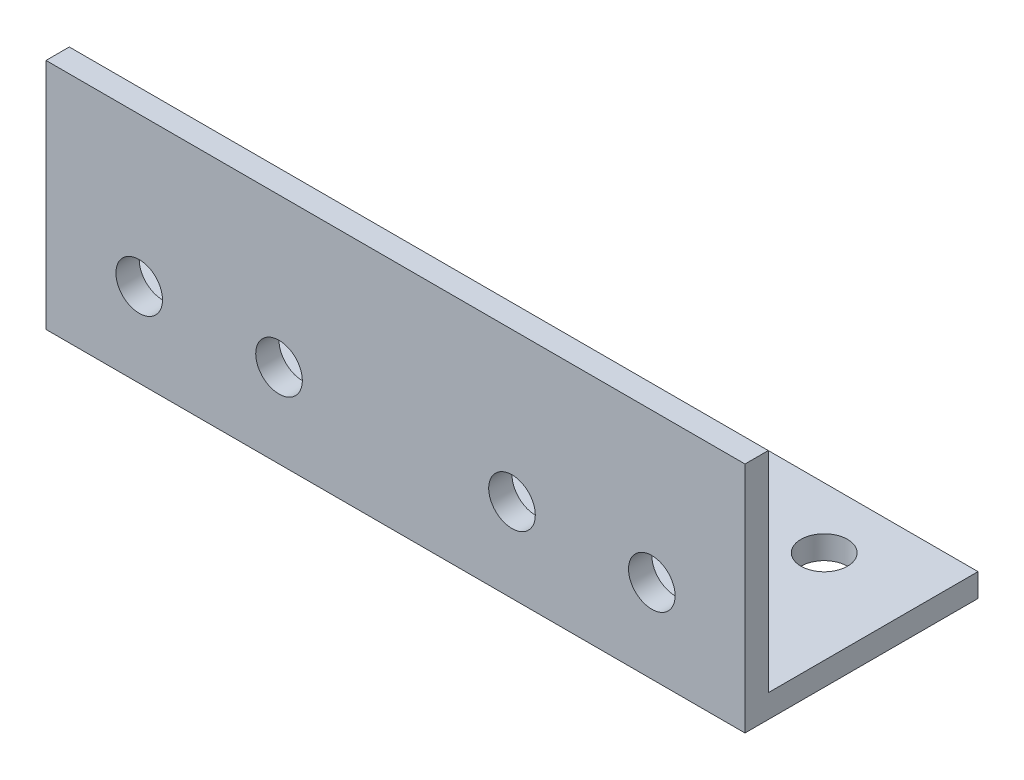
ISO-10303-21;
HEADER;
FILE_DESCRIPTION(('STEP AP214'),'2;1');
FILE_NAME('part.step','',(''),(''),'','','');
FILE_SCHEMA(('AUTOMOTIVE_DESIGN { 1 0 10303 214 1 1 1 1 }'));
ENDSEC;
DATA;
#1=APPLICATION_CONTEXT('core data for automotive mechanical design processes');
#2=APPLICATION_PROTOCOL_DEFINITION('international standard','automotive_design',2000,#1);
#3=PRODUCT_CONTEXT('',#1,'mechanical');
#4=PRODUCT('Part','Part','',(#3));
#5=PRODUCT_RELATED_PRODUCT_CATEGORY('part','',(#4));
#6=PRODUCT_DEFINITION_FORMATION('','',#4);
#7=PRODUCT_DEFINITION_CONTEXT('part definition',#1,'design');
#8=PRODUCT_DEFINITION('design','',#6,#7);
#9=PRODUCT_DEFINITION_SHAPE('','',#8);
#10=(LENGTH_UNIT() NAMED_UNIT(*) SI_UNIT(.MILLI.,.METRE.));
#11=(NAMED_UNIT(*) PLANE_ANGLE_UNIT() SI_UNIT($,.RADIAN.));
#12=(NAMED_UNIT(*) SI_UNIT($,.STERADIAN.) SOLID_ANGLE_UNIT());
#13=UNCERTAINTY_MEASURE_WITH_UNIT(LENGTH_MEASURE(1.E-05),#10,'distance_accuracy_value','');
#14=(GEOMETRIC_REPRESENTATION_CONTEXT(3) GLOBAL_UNCERTAINTY_ASSIGNED_CONTEXT((#13)) GLOBAL_UNIT_ASSIGNED_CONTEXT((#10,
#11,#12)) REPRESENTATION_CONTEXT('',''));
#15=CARTESIAN_POINT('',(0.,0.,0.));
#16=DIRECTION('',(0.,0.,1.));
#17=DIRECTION('',(1.,0.,0.));
#18=AXIS2_PLACEMENT_3D('',#15,#16,#17);
#19=CARTESIAN_POINT('',(150.,0.,0.));
#20=DIRECTION('',(0.,1.,0.));
#21=DIRECTION('',(0.,0.,1.));
#22=AXIS2_PLACEMENT_3D('',#19,#20,#21);
#23=PLANE('',#22);
#24=CARTESIAN_POINT('',(19.9999999999998,0.,-36.9999999999993));
#25=DIRECTION('',(0.,-1.,0.));
#26=DIRECTION('',(0.,0.,1.));
#27=AXIS2_PLACEMENT_3D('',#24,#25,#26);
#28=CIRCLE('',#27,4.99999999999999);
#29=CARTESIAN_POINT('',(19.9999999999998,0.,-31.9999999999993));
#30=VERTEX_POINT('',#29);
#31=EDGE_CURVE('E153',#30,#30,#28,.T.);
#32=ORIENTED_EDGE('',*,*,#31,.F.);
#33=EDGE_LOOP('',(#32));
#34=FACE_BOUND('',#33,.T.);
#35=CARTESIAN_POINT('',(49.9999999999998,0.,-36.9999999999998));
#36=DIRECTION('',(0.,-1.,0.));
#37=DIRECTION('',(0.,0.,1.));
#38=AXIS2_PLACEMENT_3D('',#35,#36,#37);
#39=CIRCLE('',#38,5.);
#40=CARTESIAN_POINT('',(49.9999999999998,0.,-31.9999999999998));
#41=VERTEX_POINT('',#40);
#42=EDGE_CURVE('E143',#41,#41,#39,.T.);
#43=ORIENTED_EDGE('',*,*,#42,.F.);
#44=EDGE_LOOP('',(#43));
#45=FACE_BOUND('',#44,.T.);
#46=CARTESIAN_POINT('',(100.,0.,-37.));
#47=DIRECTION('',(0.,-1.,0.));
#48=DIRECTION('',(0.,0.,-1.));
#49=AXIS2_PLACEMENT_3D('',#46,#47,#48);
#50=CIRCLE('',#49,4.99999999999999);
#51=CARTESIAN_POINT('',(100.,0.,-42.));
#52=VERTEX_POINT('',#51);
#53=EDGE_CURVE('E140',#52,#52,#50,.T.);
#54=ORIENTED_EDGE('',*,*,#53,.F.);
#55=EDGE_LOOP('',(#54));
#56=FACE_BOUND('',#55,.T.);
#57=CARTESIAN_POINT('',(130.,0.,-36.9999999999998));
#58=DIRECTION('',(0.,-1.,0.));
#59=DIRECTION('',(0.,0.,-1.));
#60=AXIS2_PLACEMENT_3D('',#57,#58,#59);
#61=CIRCLE('',#60,4.99999999999999);
#62=CARTESIAN_POINT('',(130.,0.,-41.9999999999998));
#63=VERTEX_POINT('',#62);
#64=EDGE_CURVE('E137',#63,#63,#61,.T.);
#65=ORIENTED_EDGE('',*,*,#64,.F.);
#66=EDGE_LOOP('',(#65));
#67=FACE_BOUND('',#66,.T.);
#68=DIRECTION('',(0.,0.,-1.));
#69=VECTOR('',#68,1.);
#70=CARTESIAN_POINT('',(0.,0.,0.));
#71=LINE('',#70,#69);
#72=CARTESIAN_POINT('',(0.,0.,0.));
#73=VERTEX_POINT('',#72);
#74=CARTESIAN_POINT('',(0.,0.,-50.));
#75=VERTEX_POINT('',#74);
#76=EDGE_CURVE('E117',#73,#75,#71,.T.);
#77=ORIENTED_EDGE('',*,*,#76,.T.);
#78=DIRECTION('',(-1.,0.,0.));
#79=VECTOR('',#78,1.);
#80=CARTESIAN_POINT('',(150.,0.,-50.));
#81=LINE('',#80,#79);
#82=CARTESIAN_POINT('',(150.,0.,-50.));
#83=VERTEX_POINT('',#82);
#84=EDGE_CURVE('E11',#83,#75,#81,.T.);
#85=ORIENTED_EDGE('',*,*,#84,.F.);
#86=DIRECTION('',(0.,0.,-1.));
#87=VECTOR('',#86,1.);
#88=CARTESIAN_POINT('',(150.,0.,0.));
#89=LINE('',#88,#87);
#90=CARTESIAN_POINT('',(150.,0.,0.));
#91=VERTEX_POINT('',#90);
#92=EDGE_CURVE('E82',#91,#83,#89,.T.);
#93=ORIENTED_EDGE('',*,*,#92,.F.);
#94=DIRECTION('',(-1.,0.,0.));
#95=VECTOR('',#94,1.);
#96=CARTESIAN_POINT('',(150.,0.,0.));
#97=LINE('',#96,#95);
#98=EDGE_CURVE('E113',#91,#73,#97,.T.);
#99=ORIENTED_EDGE('',*,*,#98,.T.);
#100=EDGE_LOOP('',(#77,#85,#93,#99));
#101=FACE_BOUND('',#100,.T.);
#102=ADVANCED_FACE('F34',(#34,#45,#56,#67,#101),#23,.F.);
#103=CARTESIAN_POINT('',(150.,5.,-50.));
#104=DIRECTION('',(0.,0.,-1.));
#105=DIRECTION('',(-1.,0.,0.));
#106=AXIS2_PLACEMENT_3D('',#103,#104,#105);
#107=PLANE('',#106);
#108=DIRECTION('',(0.,-1.,0.));
#109=VECTOR('',#108,1.);
#110=CARTESIAN_POINT('',(0.,5.,-50.));
#111=LINE('',#110,#109);
#112=CARTESIAN_POINT('',(0.,5.,-50.));
#113=VERTEX_POINT('',#112);
#114=EDGE_CURVE('E120',#113,#75,#111,.T.);
#115=ORIENTED_EDGE('',*,*,#114,.F.);
#116=DIRECTION('',(-1.,0.,0.));
#117=VECTOR('',#116,1.);
#118=CARTESIAN_POINT('',(150.,5.,-50.));
#119=LINE('',#118,#117);
#120=CARTESIAN_POINT('',(150.,5.,-50.));
#121=VERTEX_POINT('',#120);
#122=EDGE_CURVE('E43',#121,#113,#119,.T.);
#123=ORIENTED_EDGE('',*,*,#122,.F.);
#124=DIRECTION('',(0.,-1.,0.));
#125=VECTOR('',#124,1.);
#126=CARTESIAN_POINT('',(150.,5.,-50.));
#127=LINE('',#126,#125);
#128=EDGE_CURVE('E160',#121,#83,#127,.T.);
#129=ORIENTED_EDGE('',*,*,#128,.T.);
#130=ORIENTED_EDGE('',*,*,#84,.T.);
#131=EDGE_LOOP('',(#115,#123,#129,#130));
#132=FACE_BOUND('',#131,.T.);
#133=ADVANCED_FACE('F184',(#132),#107,.T.);
#134=CARTESIAN_POINT('',(150.,5.,0.));
#135=DIRECTION('',(0.,1.,0.));
#136=DIRECTION('',(0.,0.,1.));
#137=AXIS2_PLACEMENT_3D('',#134,#135,#136);
#138=PLANE('',#137);
#139=CARTESIAN_POINT('',(19.9999999999998,5.,-36.9999999999993));
#140=DIRECTION('',(0.,1.,0.));
#141=DIRECTION('',(0.,0.,1.));
#142=AXIS2_PLACEMENT_3D('',#139,#140,#141);
#143=CIRCLE('',#142,4.99999999999999);
#144=CARTESIAN_POINT('',(19.9999999999998,5.,-31.9999999999993));
#145=VERTEX_POINT('',#144);
#146=EDGE_CURVE('E37',#145,#145,#143,.T.);
#147=ORIENTED_EDGE('',*,*,#146,.F.);
#148=EDGE_LOOP('',(#147));
#149=FACE_BOUND('',#148,.T.);
#150=CARTESIAN_POINT('',(49.9999999999998,5.,-36.9999999999998));
#151=DIRECTION('',(0.,1.,0.));
#152=DIRECTION('',(0.,0.,1.));
#153=AXIS2_PLACEMENT_3D('',#150,#151,#152);
#154=CIRCLE('',#153,5.);
#155=CARTESIAN_POINT('',(49.9999999999998,5.,-31.9999999999998));
#156=VERTEX_POINT('',#155);
#157=EDGE_CURVE('E141',#156,#156,#154,.T.);
#158=ORIENTED_EDGE('',*,*,#157,.F.);
#159=EDGE_LOOP('',(#158));
#160=FACE_BOUND('',#159,.T.);
#161=CARTESIAN_POINT('',(100.,5.,-37.));
#162=DIRECTION('',(0.,1.,0.));
#163=DIRECTION('',(0.,0.,1.));
#164=AXIS2_PLACEMENT_3D('',#161,#162,#163);
#165=CIRCLE('',#164,4.99999999999999);
#166=CARTESIAN_POINT('',(100.,5.,-32.));
#167=VERTEX_POINT('',#166);
#168=EDGE_CURVE('E138',#167,#167,#165,.T.);
#169=ORIENTED_EDGE('',*,*,#168,.F.);
#170=EDGE_LOOP('',(#169));
#171=FACE_BOUND('',#170,.T.);
#172=CARTESIAN_POINT('',(130.,5.,-36.9999999999998));
#173=DIRECTION('',(0.,1.,0.));
#174=DIRECTION('',(0.,0.,1.));
#175=AXIS2_PLACEMENT_3D('',#172,#173,#174);
#176=CIRCLE('',#175,4.99999999999999);
#177=CARTESIAN_POINT('',(130.,5.,-31.9999999999998));
#178=VERTEX_POINT('',#177);
#179=EDGE_CURVE('E121',#178,#178,#176,.T.);
#180=ORIENTED_EDGE('',*,*,#179,.F.);
#181=EDGE_LOOP('',(#180));
#182=FACE_BOUND('',#181,.T.);
#183=DIRECTION('',(0.,0.,-1.));
#184=VECTOR('',#183,1.);
#185=CARTESIAN_POINT('',(0.,5.,0.));
#186=LINE('',#185,#184);
#187=CARTESIAN_POINT('',(0.,5.,-5.));
#188=VERTEX_POINT('',#187);
#189=EDGE_CURVE('E124',#188,#113,#186,.T.);
#190=ORIENTED_EDGE('',*,*,#189,.F.);
#191=DIRECTION('',(-1.,0.,0.));
#192=VECTOR('',#191,1.);
#193=CARTESIAN_POINT('',(150.,5.,-5.));
#194=LINE('',#193,#192);
#195=CARTESIAN_POINT('',(150.,5.,-5.));
#196=VERTEX_POINT('',#195);
#197=EDGE_CURVE('E103',#196,#188,#194,.T.);
#198=ORIENTED_EDGE('',*,*,#197,.F.);
#199=DIRECTION('',(0.,0.,-1.));
#200=VECTOR('',#199,1.);
#201=CARTESIAN_POINT('',(150.,5.,0.));
#202=LINE('',#201,#200);
#203=EDGE_CURVE('E109',#196,#121,#202,.T.);
#204=ORIENTED_EDGE('',*,*,#203,.T.);
#205=ORIENTED_EDGE('',*,*,#122,.T.);
#206=EDGE_LOOP('',(#190,#198,#204,#205));
#207=FACE_BOUND('',#206,.T.);
#208=ADVANCED_FACE('F164',(#149,#160,#171,#182,#207),#138,.T.);
#209=CARTESIAN_POINT('',(150.,0.,-5.));
#210=DIRECTION('',(0.,0.,-1.));
#211=DIRECTION('',(-1.,0.,0.));
#212=AXIS2_PLACEMENT_3D('',#209,#210,#211);
#213=PLANE('',#212);
#214=CARTESIAN_POINT('',(20.0000000000037,18.0000000000002,-5.));
#215=DIRECTION('',(0.,0.,-1.));
#216=DIRECTION('',(-1.,0.,0.));
#217=AXIS2_PLACEMENT_3D('',#214,#215,#216);
#218=CIRCLE('',#217,5.00000000000002);
#219=CARTESIAN_POINT('',(15.0000000000037,18.0000000000002,-5.));
#220=VERTEX_POINT('',#219);
#221=EDGE_CURVE('E237',#220,#220,#218,.T.);
#222=ORIENTED_EDGE('',*,*,#221,.F.);
#223=EDGE_LOOP('',(#222));
#224=FACE_BOUND('',#223,.T.);
#225=CARTESIAN_POINT('',(50.0000000000037,18.,-5.));
#226=DIRECTION('',(0.,0.,-1.));
#227=DIRECTION('',(-1.,0.,0.));
#228=AXIS2_PLACEMENT_3D('',#225,#226,#227);
#229=CIRCLE('',#228,5.00000000000002);
#230=CARTESIAN_POINT('',(45.0000000000037,18.,-5.));
#231=VERTEX_POINT('',#230);
#232=EDGE_CURVE('E246',#231,#231,#229,.T.);
#233=ORIENTED_EDGE('',*,*,#232,.F.);
#234=EDGE_LOOP('',(#233));
#235=FACE_BOUND('',#234,.T.);
#236=CARTESIAN_POINT('',(99.9999999999963,18.,-5.));
#237=DIRECTION('',(0.,0.,-1.));
#238=DIRECTION('',(-1.,0.,0.));
#239=AXIS2_PLACEMENT_3D('',#236,#237,#238);
#240=CIRCLE('',#239,5.00000000000002);
#241=CARTESIAN_POINT('',(94.9999999999963,18.,-5.));
#242=VERTEX_POINT('',#241);
#243=EDGE_CURVE('E252',#242,#242,#240,.T.);
#244=ORIENTED_EDGE('',*,*,#243,.F.);
#245=EDGE_LOOP('',(#244));
#246=FACE_BOUND('',#245,.T.);
#247=CARTESIAN_POINT('',(129.999999999996,18.0000000000002,-5.));
#248=DIRECTION('',(0.,0.,-1.));
#249=DIRECTION('',(-1.,0.,0.));
#250=AXIS2_PLACEMENT_3D('',#247,#248,#249);
#251=CIRCLE('',#250,5.00000000000002);
#252=CARTESIAN_POINT('',(124.999999999996,18.0000000000002,-5.));
#253=VERTEX_POINT('',#252);
#254=EDGE_CURVE('E257',#253,#253,#251,.T.);
#255=ORIENTED_EDGE('',*,*,#254,.F.);
#256=EDGE_LOOP('',(#255));
#257=FACE_BOUND('',#256,.T.);
#258=DIRECTION('',(0.,1.,0.));
#259=VECTOR('',#258,1.);
#260=CARTESIAN_POINT('',(0.,0.,-5.));
#261=LINE('',#260,#259);
#262=CARTESIAN_POINT('',(0.,50.,-5.));
#263=VERTEX_POINT('',#262);
#264=EDGE_CURVE('E98',#263,#188,#261,.F.);
#265=ORIENTED_EDGE('',*,*,#264,.F.);
#266=DIRECTION('',(-1.,0.,0.));
#267=VECTOR('',#266,1.);
#268=CARTESIAN_POINT('',(150.,50.,-5.));
#269=LINE('',#268,#267);
#270=CARTESIAN_POINT('',(150.,50.,-5.));
#271=VERTEX_POINT('',#270);
#272=EDGE_CURVE('E93',#271,#263,#269,.T.);
#273=ORIENTED_EDGE('',*,*,#272,.F.);
#274=DIRECTION('',(0.,1.,0.));
#275=VECTOR('',#274,1.);
#276=CARTESIAN_POINT('',(150.,0.,-5.));
#277=LINE('',#276,#275);
#278=EDGE_CURVE('E96',#271,#196,#277,.F.);
#279=ORIENTED_EDGE('',*,*,#278,.T.);
#280=ORIENTED_EDGE('',*,*,#197,.T.);
#281=EDGE_LOOP('',(#265,#273,#279,#280));
#282=FACE_BOUND('',#281,.T.);
#283=ADVANCED_FACE('F95',(#224,#235,#246,#257,#282),#213,.T.);
#284=CARTESIAN_POINT('',(150.,50.,0.));
#285=DIRECTION('',(0.,1.,0.));
#286=DIRECTION('',(0.,0.,1.));
#287=AXIS2_PLACEMENT_3D('',#284,#285,#286);
#288=PLANE('',#287);
#289=DIRECTION('',(0.,0.,-1.));
#290=VECTOR('',#289,1.);
#291=CARTESIAN_POINT('',(0.,50.,0.));
#292=LINE('',#291,#290);
#293=CARTESIAN_POINT('',(0.,50.,0.));
#294=VERTEX_POINT('',#293);
#295=EDGE_CURVE('E128',#294,#263,#292,.T.);
#296=ORIENTED_EDGE('',*,*,#295,.F.);
#297=DIRECTION('',(-1.,0.,0.));
#298=VECTOR('',#297,1.);
#299=CARTESIAN_POINT('',(150.,50.,0.));
#300=LINE('',#299,#298);
#301=CARTESIAN_POINT('',(150.,50.,0.));
#302=VERTEX_POINT('',#301);
#303=EDGE_CURVE('E73',#302,#294,#300,.T.);
#304=ORIENTED_EDGE('',*,*,#303,.F.);
#305=DIRECTION('',(0.,0.,-1.));
#306=VECTOR('',#305,1.);
#307=CARTESIAN_POINT('',(150.,50.,0.));
#308=LINE('',#307,#306);
#309=EDGE_CURVE('E107',#302,#271,#308,.T.);
#310=ORIENTED_EDGE('',*,*,#309,.T.);
#311=ORIENTED_EDGE('',*,*,#272,.T.);
#312=EDGE_LOOP('',(#296,#304,#310,#311));
#313=FACE_BOUND('',#312,.T.);
#314=ADVANCED_FACE('F111',(#313),#288,.T.);
#315=CARTESIAN_POINT('',(150.,0.,0.));
#316=DIRECTION('',(0.,0.,-1.));
#317=DIRECTION('',(-1.,0.,0.));
#318=AXIS2_PLACEMENT_3D('',#315,#316,#317);
#319=PLANE('',#318);
#320=CARTESIAN_POINT('',(20.0000000000037,18.0000000000002,0.));
#321=DIRECTION('',(0.,0.,1.));
#322=DIRECTION('',(-1.,0.,0.));
#323=AXIS2_PLACEMENT_3D('',#320,#321,#322);
#324=CIRCLE('',#323,5.00000000000002);
#325=CARTESIAN_POINT('',(15.0000000000037,18.0000000000002,0.));
#326=VERTEX_POINT('',#325);
#327=EDGE_CURVE('E239',#326,#326,#324,.T.);
#328=ORIENTED_EDGE('',*,*,#327,.F.);
#329=EDGE_LOOP('',(#328));
#330=FACE_BOUND('',#329,.T.);
#331=CARTESIAN_POINT('',(50.0000000000037,18.,0.));
#332=DIRECTION('',(0.,0.,1.));
#333=DIRECTION('',(-1.,0.,0.));
#334=AXIS2_PLACEMENT_3D('',#331,#332,#333);
#335=CIRCLE('',#334,5.00000000000002);
#336=CARTESIAN_POINT('',(45.0000000000037,18.,0.));
#337=VERTEX_POINT('',#336);
#338=EDGE_CURVE('E241',#337,#337,#335,.T.);
#339=ORIENTED_EDGE('',*,*,#338,.F.);
#340=EDGE_LOOP('',(#339));
#341=FACE_BOUND('',#340,.T.);
#342=CARTESIAN_POINT('',(99.9999999999963,18.,0.));
#343=DIRECTION('',(0.,0.,1.));
#344=DIRECTION('',(1.,0.,0.));
#345=AXIS2_PLACEMENT_3D('',#342,#343,#344);
#346=CIRCLE('',#345,5.00000000000002);
#347=CARTESIAN_POINT('',(104.999999999996,18.,0.));
#348=VERTEX_POINT('',#347);
#349=EDGE_CURVE('E249',#348,#348,#346,.T.);
#350=ORIENTED_EDGE('',*,*,#349,.F.);
#351=EDGE_LOOP('',(#350));
#352=FACE_BOUND('',#351,.T.);
#353=CARTESIAN_POINT('',(129.999999999996,18.0000000000002,0.));
#354=DIRECTION('',(0.,0.,1.));
#355=DIRECTION('',(1.,0.,0.));
#356=AXIS2_PLACEMENT_3D('',#353,#354,#355);
#357=CIRCLE('',#356,5.00000000000002);
#358=CARTESIAN_POINT('',(134.999999999996,18.0000000000002,0.));
#359=VERTEX_POINT('',#358);
#360=EDGE_CURVE('E255',#359,#359,#357,.T.);
#361=ORIENTED_EDGE('',*,*,#360,.F.);
#362=EDGE_LOOP('',(#361));
#363=FACE_BOUND('',#362,.T.);
#364=DIRECTION('',(0.,-1.,0.));
#365=VECTOR('',#364,1.);
#366=CARTESIAN_POINT('',(0.,0.,0.));
#367=LINE('',#366,#365);
#368=EDGE_CURVE('E76',#294,#73,#367,.T.);
#369=ORIENTED_EDGE('',*,*,#368,.T.);
#370=ORIENTED_EDGE('',*,*,#98,.F.);
#371=DIRECTION('',(0.,-1.,0.));
#372=VECTOR('',#371,1.);
#373=CARTESIAN_POINT('',(150.,0.,0.));
#374=LINE('',#373,#372);
#375=EDGE_CURVE('E52',#302,#91,#374,.T.);
#376=ORIENTED_EDGE('',*,*,#375,.F.);
#377=ORIENTED_EDGE('',*,*,#303,.T.);
#378=EDGE_LOOP('',(#369,#370,#376,#377));
#379=FACE_BOUND('',#378,.T.);
#380=ADVANCED_FACE('F170',(#330,#341,#352,#363,#379),#319,.F.);
#381=CARTESIAN_POINT('',(150.,0.,0.));
#382=DIRECTION('',(-1.,0.,0.));
#383=DIRECTION('',(0.,0.,1.));
#384=AXIS2_PLACEMENT_3D('',#381,#382,#383);
#385=PLANE('',#384);
#386=ORIENTED_EDGE('',*,*,#92,.T.);
#387=ORIENTED_EDGE('',*,*,#128,.F.);
#388=ORIENTED_EDGE('',*,*,#203,.F.);
#389=ORIENTED_EDGE('',*,*,#278,.F.);
#390=ORIENTED_EDGE('',*,*,#309,.F.);
#391=ORIENTED_EDGE('',*,*,#375,.T.);
#392=EDGE_LOOP('',(#386,#387,#388,#389,#390,#391));
#393=FACE_BOUND('',#392,.T.);
#394=ADVANCED_FACE('F106',(#393),#385,.F.);
#395=CARTESIAN_POINT('',(0.,0.,0.));
#396=DIRECTION('',(-1.,0.,0.));
#397=DIRECTION('',(0.,0.,1.));
#398=AXIS2_PLACEMENT_3D('',#395,#396,#397);
#399=PLANE('',#398);
#400=ORIENTED_EDGE('',*,*,#76,.F.);
#401=ORIENTED_EDGE('',*,*,#368,.F.);
#402=ORIENTED_EDGE('',*,*,#295,.T.);
#403=ORIENTED_EDGE('',*,*,#264,.T.);
#404=ORIENTED_EDGE('',*,*,#189,.T.);
#405=ORIENTED_EDGE('',*,*,#114,.T.);
#406=EDGE_LOOP('',(#400,#401,#402,#403,#404,#405));
#407=FACE_BOUND('',#406,.T.);
#408=ADVANCED_FACE('F168',(#407),#399,.T.);
#409=CARTESIAN_POINT('',(130.,50.,-36.9999999999998));
#410=DIRECTION('',(0.,-1.,0.));
#411=DIRECTION('',(0.,0.,-1.));
#412=AXIS2_PLACEMENT_3D('',#409,#410,#411);
#413=CYLINDRICAL_SURFACE('',#412,4.99999999999999);
#414=ORIENTED_EDGE('',*,*,#179,.T.);
#415=EDGE_LOOP('',(#414));
#416=FACE_BOUND('',#415,.T.);
#417=ORIENTED_EDGE('',*,*,#64,.T.);
#418=EDGE_LOOP('',(#417));
#419=FACE_BOUND('',#418,.T.);
#420=ADVANCED_FACE('F198',(#416,#419),#413,.F.);
#421=CARTESIAN_POINT('',(100.,50.,-37.));
#422=DIRECTION('',(0.,-1.,0.));
#423=DIRECTION('',(0.,0.,-1.));
#424=AXIS2_PLACEMENT_3D('',#421,#422,#423);
#425=CYLINDRICAL_SURFACE('',#424,4.99999999999999);
#426=ORIENTED_EDGE('',*,*,#168,.T.);
#427=EDGE_LOOP('',(#426));
#428=FACE_BOUND('',#427,.T.);
#429=ORIENTED_EDGE('',*,*,#53,.T.);
#430=EDGE_LOOP('',(#429));
#431=FACE_BOUND('',#430,.T.);
#432=ADVANCED_FACE('F200',(#428,#431),#425,.F.);
#433=CARTESIAN_POINT('',(49.9999999999998,50.,-36.9999999999998));
#434=DIRECTION('',(0.,-1.,0.));
#435=DIRECTION('',(0.,0.,-1.));
#436=AXIS2_PLACEMENT_3D('',#433,#434,#435);
#437=CYLINDRICAL_SURFACE('',#436,5.);
#438=ORIENTED_EDGE('',*,*,#157,.T.);
#439=EDGE_LOOP('',(#438));
#440=FACE_BOUND('',#439,.T.);
#441=ORIENTED_EDGE('',*,*,#42,.T.);
#442=EDGE_LOOP('',(#441));
#443=FACE_BOUND('',#442,.T.);
#444=ADVANCED_FACE('F207',(#440,#443),#437,.F.);
#445=CARTESIAN_POINT('',(19.9999999999998,50.,-36.9999999999993));
#446=DIRECTION('',(0.,-1.,0.));
#447=DIRECTION('',(0.,0.,-1.));
#448=AXIS2_PLACEMENT_3D('',#445,#446,#447);
#449=CYLINDRICAL_SURFACE('',#448,4.99999999999999);
#450=ORIENTED_EDGE('',*,*,#146,.T.);
#451=EDGE_LOOP('',(#450));
#452=FACE_BOUND('',#451,.T.);
#453=ORIENTED_EDGE('',*,*,#31,.T.);
#454=EDGE_LOOP('',(#453));
#455=FACE_BOUND('',#454,.T.);
#456=ADVANCED_FACE('F213',(#452,#455),#449,.F.);
#457=CARTESIAN_POINT('',(129.999999999996,18.0000000000002,-50.));
#458=DIRECTION('',(0.,0.,1.));
#459=DIRECTION('',(1.,0.,0.));
#460=AXIS2_PLACEMENT_3D('',#457,#458,#459);
#461=CYLINDRICAL_SURFACE('',#460,5.00000000000002);
#462=ORIENTED_EDGE('',*,*,#254,.T.);
#463=EDGE_LOOP('',(#462));
#464=FACE_BOUND('',#463,.T.);
#465=ORIENTED_EDGE('',*,*,#360,.T.);
#466=EDGE_LOOP('',(#465));
#467=FACE_BOUND('',#466,.T.);
#468=ADVANCED_FACE('F216',(#464,#467),#461,.F.);
#469=CARTESIAN_POINT('',(99.9999999999963,18.,-50.));
#470=DIRECTION('',(0.,0.,1.));
#471=DIRECTION('',(1.,0.,0.));
#472=AXIS2_PLACEMENT_3D('',#469,#470,#471);
#473=CYLINDRICAL_SURFACE('',#472,5.00000000000002);
#474=ORIENTED_EDGE('',*,*,#243,.T.);
#475=EDGE_LOOP('',(#474));
#476=FACE_BOUND('',#475,.T.);
#477=ORIENTED_EDGE('',*,*,#349,.T.);
#478=EDGE_LOOP('',(#477));
#479=FACE_BOUND('',#478,.T.);
#480=ADVANCED_FACE('F220',(#476,#479),#473,.F.);
#481=CARTESIAN_POINT('',(50.0000000000037,18.,-50.));
#482=DIRECTION('',(0.,0.,1.));
#483=DIRECTION('',(1.,0.,0.));
#484=AXIS2_PLACEMENT_3D('',#481,#482,#483);
#485=CYLINDRICAL_SURFACE('',#484,5.00000000000002);
#486=ORIENTED_EDGE('',*,*,#232,.T.);
#487=EDGE_LOOP('',(#486));
#488=FACE_BOUND('',#487,.T.);
#489=ORIENTED_EDGE('',*,*,#338,.T.);
#490=EDGE_LOOP('',(#489));
#491=FACE_BOUND('',#490,.T.);
#492=ADVANCED_FACE('F224',(#488,#491),#485,.F.);
#493=CARTESIAN_POINT('',(20.0000000000037,18.0000000000002,-50.));
#494=DIRECTION('',(0.,0.,1.));
#495=DIRECTION('',(1.,0.,0.));
#496=AXIS2_PLACEMENT_3D('',#493,#494,#495);
#497=CYLINDRICAL_SURFACE('',#496,5.00000000000002);
#498=ORIENTED_EDGE('',*,*,#221,.T.);
#499=EDGE_LOOP('',(#498));
#500=FACE_BOUND('',#499,.T.);
#501=ORIENTED_EDGE('',*,*,#327,.T.);
#502=EDGE_LOOP('',(#501));
#503=FACE_BOUND('',#502,.T.);
#504=ADVANCED_FACE('F228',(#500,#503),#497,.F.);
#505=CLOSED_SHELL('',(#102,#133,#208,#283,#314,#380,#394,#408,#420,#432,#444,#456,#468,#480,
#492,#504));
#506=MANIFOLD_SOLID_BREP('B2',#505);
#507=ADVANCED_BREP_SHAPE_REPRESENTATION('',(#18,#506),#14);
#508=SHAPE_DEFINITION_REPRESENTATION(#9,#507);
ENDSEC;
END-ISO-10303-21;
